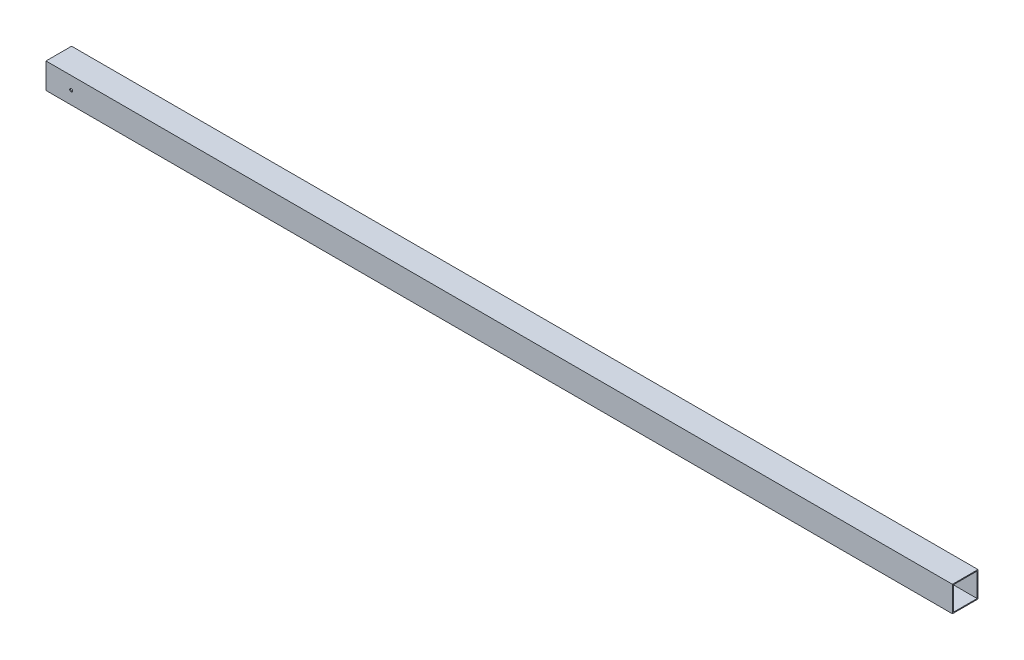
ISO-10303-21;
HEADER;
FILE_DESCRIPTION(('STEP AP214'),'2;1');
FILE_NAME('part.step','',(''),(''),'','','');
FILE_SCHEMA(('AUTOMOTIVE_DESIGN { 1 0 10303 214 1 1 1 1 }'));
ENDSEC;
DATA;
#1=APPLICATION_CONTEXT('core data for automotive mechanical design processes');
#2=APPLICATION_PROTOCOL_DEFINITION('international standard','automotive_design',2000,#1);
#3=PRODUCT_CONTEXT('',#1,'mechanical');
#4=PRODUCT('Part','Part','',(#3));
#5=PRODUCT_RELATED_PRODUCT_CATEGORY('part','',(#4));
#6=PRODUCT_DEFINITION_FORMATION('','',#4);
#7=PRODUCT_DEFINITION_CONTEXT('part definition',#1,'design');
#8=PRODUCT_DEFINITION('design','',#6,#7);
#9=PRODUCT_DEFINITION_SHAPE('','',#8);
#10=(LENGTH_UNIT() NAMED_UNIT(*) SI_UNIT(.MILLI.,.METRE.));
#11=(NAMED_UNIT(*) PLANE_ANGLE_UNIT() SI_UNIT($,.RADIAN.));
#12=(NAMED_UNIT(*) SI_UNIT($,.STERADIAN.) SOLID_ANGLE_UNIT());
#13=UNCERTAINTY_MEASURE_WITH_UNIT(LENGTH_MEASURE(1.E-05),#10,'distance_accuracy_value','');
#14=(GEOMETRIC_REPRESENTATION_CONTEXT(3) GLOBAL_UNCERTAINTY_ASSIGNED_CONTEXT((#13)) GLOBAL_UNIT_ASSIGNED_CONTEXT((#10,
#11,#12)) REPRESENTATION_CONTEXT('',''));
#15=CARTESIAN_POINT('',(0.,0.,0.));
#16=DIRECTION('',(0.,0.,1.));
#17=DIRECTION('',(1.,0.,0.));
#18=AXIS2_PLACEMENT_3D('',#15,#16,#17);
#19=CARTESIAN_POINT('',(450.,12.7,-12.7));
#20=DIRECTION('',(0.,0.,1.));
#21=DIRECTION('',(0.,-1.,0.));
#22=AXIS2_PLACEMENT_3D('',#19,#20,#21);
#23=PLANE('',#22);
#24=CARTESIAN_POINT('',(-425.,0.,-12.7));
#25=DIRECTION('',(0.,0.,1.));
#26=DIRECTION('',(0.,-1.,0.));
#27=AXIS2_PLACEMENT_3D('',#24,#25,#26);
#28=CIRCLE('',#27,1.50000000000002);
#29=CARTESIAN_POINT('',(-425.,-1.50000000000003,-12.7));
#30=VERTEX_POINT('',#29);
#31=EDGE_CURVE('E135',#30,#30,#28,.T.);
#32=ORIENTED_EDGE('',*,*,#31,.T.);
#33=EDGE_LOOP('',(#32));
#34=FACE_BOUND('',#33,.T.);
#35=DIRECTION('',(0.,1.,0.));
#36=VECTOR('',#35,1.);
#37=CARTESIAN_POINT('',(-450.,12.7,-12.7));
#38=LINE('',#37,#36);
#39=CARTESIAN_POINT('',(-450.,-12.7,-12.7));
#40=VERTEX_POINT('',#39);
#41=CARTESIAN_POINT('',(-450.,12.7,-12.7));
#42=VERTEX_POINT('',#41);
#43=EDGE_CURVE('E144',#40,#42,#38,.T.);
#44=ORIENTED_EDGE('',*,*,#43,.T.);
#45=DIRECTION('',(-1.,0.,0.));
#46=VECTOR('',#45,1.);
#47=CARTESIAN_POINT('',(450.,12.7,-12.7));
#48=LINE('',#47,#46);
#49=CARTESIAN_POINT('',(450.,12.7,-12.7));
#50=VERTEX_POINT('',#49);
#51=EDGE_CURVE('E12',#50,#42,#48,.T.);
#52=ORIENTED_EDGE('',*,*,#51,.F.);
#53=DIRECTION('',(0.,1.,0.));
#54=VECTOR('',#53,1.);
#55=CARTESIAN_POINT('',(450.,12.7,-12.7));
#56=LINE('',#55,#54);
#57=CARTESIAN_POINT('',(450.,-12.7,-12.7));
#58=VERTEX_POINT('',#57);
#59=EDGE_CURVE('E117',#58,#50,#56,.T.);
#60=ORIENTED_EDGE('',*,*,#59,.F.);
#61=DIRECTION('',(-1.,0.,0.));
#62=VECTOR('',#61,1.);
#63=CARTESIAN_POINT('',(450.,-12.7,-12.7));
#64=LINE('',#63,#62);
#65=EDGE_CURVE('E151',#58,#40,#64,.T.);
#66=ORIENTED_EDGE('',*,*,#65,.T.);
#67=EDGE_LOOP('',(#44,#52,#60,#66));
#68=FACE_BOUND('',#67,.T.);
#69=ADVANCED_FACE('F35',(#34,#68),#23,.F.);
#70=CARTESIAN_POINT('',(450.,12.7,-12.7));
#71=DIRECTION('',(0.,-1.,0.));
#72=DIRECTION('',(0.,0.,-1.));
#73=AXIS2_PLACEMENT_3D('',#70,#71,#72);
#74=PLANE('',#73);
#75=DIRECTION('',(0.,0.,1.));
#76=VECTOR('',#75,1.);
#77=CARTESIAN_POINT('',(-450.,12.7,-12.7));
#78=LINE('',#77,#76);
#79=CARTESIAN_POINT('',(-450.,12.7,12.7));
#80=VERTEX_POINT('',#79);
#81=EDGE_CURVE('E122',#42,#80,#78,.T.);
#82=ORIENTED_EDGE('',*,*,#81,.T.);
#83=DIRECTION('',(-1.,0.,0.));
#84=VECTOR('',#83,1.);
#85=CARTESIAN_POINT('',(450.,12.7,12.7));
#86=LINE('',#85,#84);
#87=CARTESIAN_POINT('',(450.,12.7,12.7));
#88=VERTEX_POINT('',#87);
#89=EDGE_CURVE('E45',#88,#80,#86,.T.);
#90=ORIENTED_EDGE('',*,*,#89,.F.);
#91=DIRECTION('',(0.,0.,1.));
#92=VECTOR('',#91,1.);
#93=CARTESIAN_POINT('',(450.,12.7,-12.7));
#94=LINE('',#93,#92);
#95=EDGE_CURVE('E111',#50,#88,#94,.T.);
#96=ORIENTED_EDGE('',*,*,#95,.F.);
#97=ORIENTED_EDGE('',*,*,#51,.T.);
#98=EDGE_LOOP('',(#82,#90,#96,#97));
#99=FACE_BOUND('',#98,.T.);
#100=ADVANCED_FACE('F121',(#99),#74,.F.);
#101=CARTESIAN_POINT('',(450.,-12.7,12.7));
#102=DIRECTION('',(0.,0.,-1.));
#103=DIRECTION('',(0.,1.,0.));
#104=AXIS2_PLACEMENT_3D('',#101,#102,#103);
#105=PLANE('',#104);
#106=CARTESIAN_POINT('',(-425.,0.,12.7));
#107=DIRECTION('',(0.,0.,-1.));
#108=DIRECTION('',(0.,1.,0.));
#109=AXIS2_PLACEMENT_3D('',#106,#107,#108);
#110=CIRCLE('',#109,1.50000000000002);
#111=CARTESIAN_POINT('',(-425.,1.5,12.7));
#112=VERTEX_POINT('',#111);
#113=EDGE_CURVE('E226',#112,#112,#110,.T.);
#114=ORIENTED_EDGE('',*,*,#113,.T.);
#115=EDGE_LOOP('',(#114));
#116=FACE_BOUND('',#115,.T.);
#117=DIRECTION('',(0.,-1.,0.));
#118=VECTOR('',#117,1.);
#119=CARTESIAN_POINT('',(-450.,-12.7,12.7));
#120=LINE('',#119,#118);
#121=CARTESIAN_POINT('',(-450.,-12.7,12.7));
#122=VERTEX_POINT('',#121);
#123=EDGE_CURVE('E83',#80,#122,#120,.T.);
#124=ORIENTED_EDGE('',*,*,#123,.T.);
#125=DIRECTION('',(-1.,0.,0.));
#126=VECTOR('',#125,1.);
#127=CARTESIAN_POINT('',(450.,-12.7,12.7));
#128=LINE('',#127,#126);
#129=CARTESIAN_POINT('',(450.,-12.7,12.7));
#130=VERTEX_POINT('',#129);
#131=EDGE_CURVE('E123',#130,#122,#128,.T.);
#132=ORIENTED_EDGE('',*,*,#131,.F.);
#133=DIRECTION('',(0.,-1.,0.));
#134=VECTOR('',#133,1.);
#135=CARTESIAN_POINT('',(450.,-12.7,12.7));
#136=LINE('',#135,#134);
#137=EDGE_CURVE('E115',#88,#130,#136,.T.);
#138=ORIENTED_EDGE('',*,*,#137,.F.);
#139=ORIENTED_EDGE('',*,*,#89,.T.);
#140=EDGE_LOOP('',(#124,#132,#138,#139));
#141=FACE_BOUND('',#140,.T.);
#142=ADVANCED_FACE('F125',(#116,#141),#105,.F.);
#143=CARTESIAN_POINT('',(450.,11.811,-11.811));
#144=DIRECTION('',(0.,-1.,0.));
#145=DIRECTION('',(0.,0.,-1.));
#146=AXIS2_PLACEMENT_3D('',#143,#144,#145);
#147=PLANE('',#146);
#148=DIRECTION('',(0.,0.,1.));
#149=VECTOR('',#148,1.);
#150=CARTESIAN_POINT('',(-450.,11.811,-11.811));
#151=LINE('',#150,#149);
#152=CARTESIAN_POINT('',(-450.,11.811,-11.811));
#153=VERTEX_POINT('',#152);
#154=CARTESIAN_POINT('',(-450.,11.811,11.811));
#155=VERTEX_POINT('',#154);
#156=EDGE_CURVE('E131',#153,#155,#151,.T.);
#157=ORIENTED_EDGE('',*,*,#156,.F.);
#158=DIRECTION('',(-1.,0.,0.));
#159=VECTOR('',#158,1.);
#160=CARTESIAN_POINT('',(450.,11.811,-11.811));
#161=LINE('',#160,#159);
#162=CARTESIAN_POINT('',(450.,11.811,-11.811));
#163=VERTEX_POINT('',#162);
#164=EDGE_CURVE('E97',#163,#153,#161,.T.);
#165=ORIENTED_EDGE('',*,*,#164,.F.);
#166=DIRECTION('',(0.,0.,1.));
#167=VECTOR('',#166,1.);
#168=CARTESIAN_POINT('',(450.,11.811,-11.811));
#169=LINE('',#168,#167);
#170=CARTESIAN_POINT('',(450.,11.811,11.811));
#171=VERTEX_POINT('',#170);
#172=EDGE_CURVE('E150',#163,#171,#169,.T.);
#173=ORIENTED_EDGE('',*,*,#172,.T.);
#174=DIRECTION('',(-1.,0.,0.));
#175=VECTOR('',#174,1.);
#176=CARTESIAN_POINT('',(450.,11.811,11.811));
#177=LINE('',#176,#175);
#178=EDGE_CURVE('E127',#171,#155,#177,.T.);
#179=ORIENTED_EDGE('',*,*,#178,.T.);
#180=EDGE_LOOP('',(#157,#165,#173,#179));
#181=FACE_BOUND('',#180,.T.);
#182=ADVANCED_FACE('F37',(#181),#147,.T.);
#183=CARTESIAN_POINT('',(450.,11.811,-11.811));
#184=DIRECTION('',(0.,0.,1.));
#185=DIRECTION('',(1.,0.,0.));
#186=AXIS2_PLACEMENT_3D('',#183,#184,#185);
#187=PLANE('',#186);
#188=CARTESIAN_POINT('',(-425.,0.,-11.811));
#189=DIRECTION('',(0.,0.,1.));
#190=DIRECTION('',(1.,0.,0.));
#191=AXIS2_PLACEMENT_3D('',#188,#189,#190);
#192=CIRCLE('',#191,1.50000000000002);
#193=CARTESIAN_POINT('',(-423.5,0.,-11.811));
#194=VERTEX_POINT('',#193);
#195=EDGE_CURVE('E224',#194,#194,#192,.T.);
#196=ORIENTED_EDGE('',*,*,#195,.F.);
#197=EDGE_LOOP('',(#196));
#198=FACE_BOUND('',#197,.T.);
#199=DIRECTION('',(0.,1.,0.));
#200=VECTOR('',#199,1.);
#201=CARTESIAN_POINT('',(-450.,11.811,-11.811));
#202=LINE('',#201,#200);
#203=CARTESIAN_POINT('',(-450.,-11.811,-11.811));
#204=VERTEX_POINT('',#203);
#205=EDGE_CURVE('E134',#204,#153,#202,.T.);
#206=ORIENTED_EDGE('',*,*,#205,.F.);
#207=DIRECTION('',(-1.,0.,0.));
#208=VECTOR('',#207,1.);
#209=CARTESIAN_POINT('',(450.,-11.811,-11.811));
#210=LINE('',#209,#208);
#211=CARTESIAN_POINT('',(450.,-11.811,-11.811));
#212=VERTEX_POINT('',#211);
#213=EDGE_CURVE('E157',#212,#204,#210,.T.);
#214=ORIENTED_EDGE('',*,*,#213,.F.);
#215=DIRECTION('',(0.,1.,0.));
#216=VECTOR('',#215,1.);
#217=CARTESIAN_POINT('',(450.,11.811,-11.811));
#218=LINE('',#217,#216);
#219=EDGE_CURVE('E163',#212,#163,#218,.T.);
#220=ORIENTED_EDGE('',*,*,#219,.T.);
#221=ORIENTED_EDGE('',*,*,#164,.T.);
#222=EDGE_LOOP('',(#206,#214,#220,#221));
#223=FACE_BOUND('',#222,.T.);
#224=ADVANCED_FACE('F161',(#198,#223),#187,.T.);
#225=CARTESIAN_POINT('',(450.,-11.811,11.811));
#226=DIRECTION('',(0.,1.,0.));
#227=DIRECTION('',(0.,0.,1.));
#228=AXIS2_PLACEMENT_3D('',#225,#226,#227);
#229=PLANE('',#228);
#230=DIRECTION('',(0.,0.,-1.));
#231=VECTOR('',#230,1.);
#232=CARTESIAN_POINT('',(-450.,-11.811,11.811));
#233=LINE('',#232,#231);
#234=CARTESIAN_POINT('',(-450.,-11.811,11.811));
#235=VERTEX_POINT('',#234);
#236=EDGE_CURVE('E138',#235,#204,#233,.T.);
#237=ORIENTED_EDGE('',*,*,#236,.F.);
#238=DIRECTION('',(-1.,0.,0.));
#239=VECTOR('',#238,1.);
#240=CARTESIAN_POINT('',(450.,-11.811,11.811));
#241=LINE('',#240,#239);
#242=CARTESIAN_POINT('',(450.,-11.811,11.811));
#243=VERTEX_POINT('',#242);
#244=EDGE_CURVE('E155',#243,#235,#241,.T.);
#245=ORIENTED_EDGE('',*,*,#244,.F.);
#246=DIRECTION('',(0.,0.,-1.));
#247=VECTOR('',#246,1.);
#248=CARTESIAN_POINT('',(450.,-11.811,11.811));
#249=LINE('',#248,#247);
#250=EDGE_CURVE('E173',#243,#212,#249,.T.);
#251=ORIENTED_EDGE('',*,*,#250,.T.);
#252=ORIENTED_EDGE('',*,*,#213,.T.);
#253=EDGE_LOOP('',(#237,#245,#251,#252));
#254=FACE_BOUND('',#253,.T.);
#255=ADVANCED_FACE('F170',(#254),#229,.T.);
#256=CARTESIAN_POINT('',(450.,-11.811,11.811));
#257=DIRECTION('',(0.,0.,-1.));
#258=DIRECTION('',(-1.,0.,0.));
#259=AXIS2_PLACEMENT_3D('',#256,#257,#258);
#260=PLANE('',#259);
#261=CARTESIAN_POINT('',(-425.,0.,11.811));
#262=DIRECTION('',(0.,0.,-1.));
#263=DIRECTION('',(-1.,0.,0.));
#264=AXIS2_PLACEMENT_3D('',#261,#262,#263);
#265=CIRCLE('',#264,1.50000000000002);
#266=CARTESIAN_POINT('',(-426.5,0.,11.811));
#267=VERTEX_POINT('',#266);
#268=EDGE_CURVE('E39',#267,#267,#265,.T.);
#269=ORIENTED_EDGE('',*,*,#268,.F.);
#270=EDGE_LOOP('',(#269));
#271=FACE_BOUND('',#270,.T.);
#272=DIRECTION('',(0.,-1.,0.));
#273=VECTOR('',#272,1.);
#274=CARTESIAN_POINT('',(-450.,-11.811,11.811));
#275=LINE('',#274,#273);
#276=EDGE_CURVE('E141',#155,#235,#275,.T.);
#277=ORIENTED_EDGE('',*,*,#276,.F.);
#278=ORIENTED_EDGE('',*,*,#178,.F.);
#279=DIRECTION('',(0.,-1.,0.));
#280=VECTOR('',#279,1.);
#281=CARTESIAN_POINT('',(450.,-11.811,11.811));
#282=LINE('',#281,#280);
#283=EDGE_CURVE('E178',#171,#243,#282,.T.);
#284=ORIENTED_EDGE('',*,*,#283,.T.);
#285=ORIENTED_EDGE('',*,*,#244,.T.);
#286=EDGE_LOOP('',(#277,#278,#284,#285));
#287=FACE_BOUND('',#286,.T.);
#288=ADVANCED_FACE('F184',(#271,#287),#260,.T.);
#289=CARTESIAN_POINT('',(450.,-12.7,12.7));
#290=DIRECTION('',(0.,1.,0.));
#291=DIRECTION('',(0.,0.,1.));
#292=AXIS2_PLACEMENT_3D('',#289,#290,#291);
#293=PLANE('',#292);
#294=DIRECTION('',(0.,0.,-1.));
#295=VECTOR('',#294,1.);
#296=CARTESIAN_POINT('',(-450.,-12.7,12.7));
#297=LINE('',#296,#295);
#298=EDGE_CURVE('E89',#122,#40,#297,.T.);
#299=ORIENTED_EDGE('',*,*,#298,.T.);
#300=ORIENTED_EDGE('',*,*,#65,.F.);
#301=DIRECTION('',(0.,0.,-1.));
#302=VECTOR('',#301,1.);
#303=CARTESIAN_POINT('',(450.,-12.7,12.7));
#304=LINE('',#303,#302);
#305=EDGE_CURVE('E54',#130,#58,#304,.T.);
#306=ORIENTED_EDGE('',*,*,#305,.F.);
#307=ORIENTED_EDGE('',*,*,#131,.T.);
#308=EDGE_LOOP('',(#299,#300,#306,#307));
#309=FACE_BOUND('',#308,.T.);
#310=ADVANCED_FACE('F186',(#309),#293,.F.);
#311=CARTESIAN_POINT('',(450.,0.,0.));
#312=DIRECTION('',(1.,0.,0.));
#313=DIRECTION('',(0.,0.,-1.));
#314=AXIS2_PLACEMENT_3D('',#311,#312,#313);
#315=PLANE('',#314);
#316=ORIENTED_EDGE('',*,*,#172,.F.);
#317=ORIENTED_EDGE('',*,*,#219,.F.);
#318=ORIENTED_EDGE('',*,*,#250,.F.);
#319=ORIENTED_EDGE('',*,*,#283,.F.);
#320=EDGE_LOOP('',(#316,#317,#318,#319));
#321=FACE_BOUND('',#320,.T.);
#322=ORIENTED_EDGE('',*,*,#59,.T.);
#323=ORIENTED_EDGE('',*,*,#95,.T.);
#324=ORIENTED_EDGE('',*,*,#137,.T.);
#325=ORIENTED_EDGE('',*,*,#305,.T.);
#326=EDGE_LOOP('',(#322,#323,#324,#325));
#327=FACE_BOUND('',#326,.T.);
#328=ADVANCED_FACE('F113',(#321,#327),#315,.T.);
#329=CARTESIAN_POINT('',(-450.,0.,0.));
#330=DIRECTION('',(1.,0.,0.));
#331=DIRECTION('',(0.,0.,-1.));
#332=AXIS2_PLACEMENT_3D('',#329,#330,#331);
#333=PLANE('',#332);
#334=ORIENTED_EDGE('',*,*,#156,.T.);
#335=ORIENTED_EDGE('',*,*,#276,.T.);
#336=ORIENTED_EDGE('',*,*,#236,.T.);
#337=ORIENTED_EDGE('',*,*,#205,.T.);
#338=EDGE_LOOP('',(#334,#335,#336,#337));
#339=FACE_BOUND('',#338,.T.);
#340=ORIENTED_EDGE('',*,*,#43,.F.);
#341=ORIENTED_EDGE('',*,*,#298,.F.);
#342=ORIENTED_EDGE('',*,*,#123,.F.);
#343=ORIENTED_EDGE('',*,*,#81,.F.);
#344=EDGE_LOOP('',(#340,#341,#342,#343));
#345=FACE_BOUND('',#344,.T.);
#346=ADVANCED_FACE('F166',(#339,#345),#333,.F.);
#347=CARTESIAN_POINT('',(-425.,-1.67694489091081E-13,284.7));
#348=DIRECTION('',(0.,0.,-1.));
#349=DIRECTION('',(0.,1.,0.));
#350=AXIS2_PLACEMENT_3D('',#347,#348,#349);
#351=CYLINDRICAL_SURFACE('',#350,1.50000000000002);
#352=ORIENTED_EDGE('',*,*,#268,.T.);
#353=EDGE_LOOP('',(#352));
#354=FACE_BOUND('',#353,.T.);
#355=ORIENTED_EDGE('',*,*,#113,.F.);
#356=EDGE_LOOP('',(#355));
#357=FACE_BOUND('',#356,.T.);
#358=ADVANCED_FACE('F211',(#354,#357),#351,.F.);
#359=ORIENTED_EDGE('',*,*,#195,.T.);
#360=EDGE_LOOP('',(#359));
#361=FACE_BOUND('',#360,.T.);
#362=ORIENTED_EDGE('',*,*,#31,.F.);
#363=EDGE_LOOP('',(#362));
#364=FACE_BOUND('',#363,.T.);
#365=ADVANCED_FACE('F214',(#361,#364),#351,.F.);
#366=CLOSED_SHELL('',(#69,#100,#142,#182,#224,#255,#288,#310,#328,#346,#358,#365));
#367=MANIFOLD_SOLID_BREP('B2',#366);
#368=ADVANCED_BREP_SHAPE_REPRESENTATION('',(#18,#367),#14);
#369=SHAPE_DEFINITION_REPRESENTATION(#9,#368);
ENDSEC;
END-ISO-10303-21;
